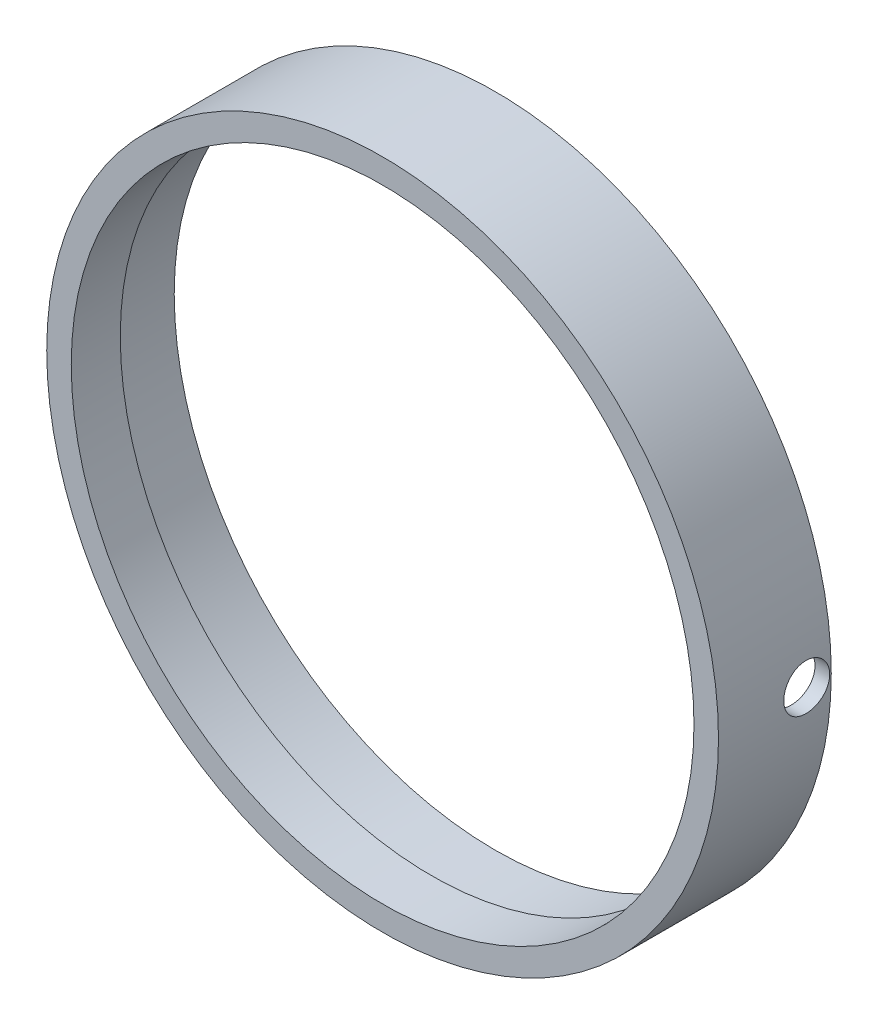
ISO-10303-21;
HEADER;
FILE_DESCRIPTION(('STEP AP214'),'2;1');
FILE_NAME('part.step','',(''),(''),'','','');
FILE_SCHEMA(('AUTOMOTIVE_DESIGN { 1 0 10303 214 1 1 1 1 }'));
ENDSEC;
DATA;
#1=APPLICATION_CONTEXT('core data for automotive mechanical design processes');
#2=APPLICATION_PROTOCOL_DEFINITION('international standard','automotive_design',2000,#1);
#3=PRODUCT_CONTEXT('',#1,'mechanical');
#4=PRODUCT('Part','Part','',(#3));
#5=PRODUCT_RELATED_PRODUCT_CATEGORY('part','',(#4));
#6=PRODUCT_DEFINITION_FORMATION('','',#4);
#7=PRODUCT_DEFINITION_CONTEXT('part definition',#1,'design');
#8=PRODUCT_DEFINITION('design','',#6,#7);
#9=PRODUCT_DEFINITION_SHAPE('','',#8);
#10=(LENGTH_UNIT() NAMED_UNIT(*) SI_UNIT(.MILLI.,.METRE.));
#11=(NAMED_UNIT(*) PLANE_ANGLE_UNIT() SI_UNIT($,.RADIAN.));
#12=(NAMED_UNIT(*) SI_UNIT($,.STERADIAN.) SOLID_ANGLE_UNIT());
#13=UNCERTAINTY_MEASURE_WITH_UNIT(LENGTH_MEASURE(1.E-05),#10,'distance_accuracy_value','');
#14=(GEOMETRIC_REPRESENTATION_CONTEXT(3) GLOBAL_UNCERTAINTY_ASSIGNED_CONTEXT((#13)) GLOBAL_UNIT_ASSIGNED_CONTEXT((#10,
#11,#12)) REPRESENTATION_CONTEXT('',''));
#15=CARTESIAN_POINT('',(0.,0.,0.));
#16=DIRECTION('',(0.,0.,1.));
#17=DIRECTION('',(1.,0.,0.));
#18=AXIS2_PLACEMENT_3D('',#15,#16,#17);
#19=CARTESIAN_POINT('',(0.,0.,11.684));
#20=DIRECTION('',(0.,0.,-1.));
#21=DIRECTION('',(-1.,0.,0.));
#22=AXIS2_PLACEMENT_3D('',#19,#20,#21);
#23=CYLINDRICAL_SURFACE('',#22,32.258);
#24=CARTESIAN_POINT('',(0.,0.,11.684));
#25=DIRECTION('',(0.,0.,1.));
#26=DIRECTION('',(1.,0.,0.));
#27=AXIS2_PLACEMENT_3D('',#24,#25,#26);
#28=CIRCLE('',#27,32.258);
#29=CARTESIAN_POINT('',(32.258,0.,11.684));
#30=VERTEX_POINT('',#29);
#31=EDGE_CURVE('E85',#30,#30,#28,.T.);
#32=ORIENTED_EDGE('',*,*,#31,.T.);
#33=EDGE_LOOP('',(#32));
#34=FACE_BOUND('',#33,.T.);
#35=CARTESIAN_POINT('',(0.,0.,6.604));
#36=DIRECTION('',(0.,0.,-1.));
#37=DIRECTION('',(-1.,0.,0.));
#38=AXIS2_PLACEMENT_3D('',#35,#36,#37);
#39=CIRCLE('',#38,32.258);
#40=CARTESIAN_POINT('',(-32.258,0.,6.604));
#41=VERTEX_POINT('',#40);
#42=EDGE_CURVE('E93',#41,#41,#39,.T.);
#43=ORIENTED_EDGE('',*,*,#42,.T.);
#44=EDGE_LOOP('',(#43));
#45=FACE_BOUND('',#44,.T.);
#46=ADVANCED_FACE('F35',(#34,#45),#23,.F.);
#47=CARTESIAN_POINT('',(0.,0.,11.684));
#48=DIRECTION('',(0.,0.,1.));
#49=DIRECTION('',(1.,0.,0.));
#50=AXIS2_PLACEMENT_3D('',#47,#48,#49);
#51=PLANE('',#50);
#52=CARTESIAN_POINT('',(0.,0.,11.684));
#53=DIRECTION('',(0.,0.,1.));
#54=DIRECTION('',(1.,0.,0.));
#55=AXIS2_PLACEMENT_3D('',#52,#53,#54);
#56=CIRCLE('',#55,34.798);
#57=CARTESIAN_POINT('',(34.798,0.,11.684));
#58=VERTEX_POINT('',#57);
#59=EDGE_CURVE('E48',#58,#58,#56,.T.);
#60=ORIENTED_EDGE('',*,*,#59,.T.);
#61=EDGE_LOOP('',(#60));
#62=FACE_BOUND('',#61,.T.);
#63=ORIENTED_EDGE('',*,*,#31,.F.);
#64=EDGE_LOOP('',(#63));
#65=FACE_BOUND('',#64,.T.);
#66=ADVANCED_FACE('F68',(#62,#65),#51,.T.);
#67=CARTESIAN_POINT('',(0.,0.,0.));
#68=DIRECTION('',(0.,0.,1.));
#69=DIRECTION('',(1.,0.,0.));
#70=AXIS2_PLACEMENT_3D('',#67,#68,#69);
#71=PLANE('',#70);
#72=CARTESIAN_POINT('',(0.,0.,0.));
#73=DIRECTION('',(0.,0.,-1.));
#74=DIRECTION('',(-1.,0.,0.));
#75=AXIS2_PLACEMENT_3D('',#72,#73,#74);
#76=CIRCLE('',#75,33.274);
#77=CARTESIAN_POINT('',(-33.274,0.,0.));
#78=VERTEX_POINT('',#77);
#79=EDGE_CURVE('E81',#78,#78,#76,.T.);
#80=ORIENTED_EDGE('',*,*,#79,.F.);
#81=EDGE_LOOP('',(#80));
#82=FACE_BOUND('',#81,.T.);
#83=CARTESIAN_POINT('',(0.,0.,0.));
#84=DIRECTION('',(0.,0.,1.));
#85=DIRECTION('',(1.,0.,0.));
#86=AXIS2_PLACEMENT_3D('',#83,#84,#85);
#87=CIRCLE('',#86,34.798);
#88=CARTESIAN_POINT('',(34.798,0.,0.));
#89=VERTEX_POINT('',#88);
#90=EDGE_CURVE('E52',#89,#89,#87,.T.);
#91=ORIENTED_EDGE('',*,*,#90,.F.);
#92=EDGE_LOOP('',(#91));
#93=FACE_BOUND('',#92,.T.);
#94=ADVANCED_FACE('F71',(#82,#93),#71,.F.);
#95=CARTESIAN_POINT('',(0.,0.,11.684));
#96=DIRECTION('',(0.,0.,-1.));
#97=DIRECTION('',(-1.,0.,0.));
#98=AXIS2_PLACEMENT_3D('',#95,#96,#97);
#99=CYLINDRICAL_SURFACE('',#98,34.798);
#100=CARTESIAN_POINT('',(34.798,0.,0.15875000000001));
#101=CARTESIAN_POINT('',(34.7979989208094,-0.133588155794999,0.158755867477085));
#102=CARTESIAN_POINT('',(34.7972225203374,-0.267269186276193,0.17002923049745));
#103=CARTESIAN_POINT('',(34.7941999484914,-0.530938106556214,0.214838030663603));
#104=CARTESIAN_POINT('',(34.7919520781104,-0.660921545744345,0.248399202687719));
#105=CARTESIAN_POINT('',(34.7862407908747,-0.913337990730339,0.336813463624141));
#106=CARTESIAN_POINT('',(34.7827780272686,-1.03577501272636,0.391655111693192));
#107=CARTESIAN_POINT('',(34.7750261272425,-1.26967444327123,0.521054515019886));
#108=CARTESIAN_POINT('',(34.7707371769327,-1.38113931492287,0.595607831353313));
#109=CARTESIAN_POINT('',(34.7618063164254,-1.59015862231136,0.762457878726961));
#110=CARTESIAN_POINT('',(34.7571638657219,-1.6876910728142,0.854782124877728));
#111=CARTESIAN_POINT('',(34.7480538278396,-1.86588872694902,1.05449605560255));
#112=CARTESIAN_POINT('',(34.7435862480674,-1.94655321677467,1.16188637741085));
#113=CARTESIAN_POINT('',(34.735325508655,-2.08879523711816,1.38881152089206));
#114=CARTESIAN_POINT('',(34.7315330087088,-2.15035414068139,1.50835804445394));
#115=CARTESIAN_POINT('',(34.725057240119,-2.25251844746636,1.75612020614468));
#116=CARTESIAN_POINT('',(34.7223739575974,-2.29312411284298,1.88433573578922));
#117=CARTESIAN_POINT('',(34.7184244498169,-2.35216732187229,2.14558151438049));
#118=CARTESIAN_POINT('',(34.7171559918817,-2.37063979642845,2.27860383442105));
#119=CARTESIAN_POINT('',(34.7161724973404,-2.38500011202866,2.54586669350074));
#120=CARTESIAN_POINT('',(34.7164574401908,-2.38088825174601,2.68010721640594));
#121=CARTESIAN_POINT('',(34.7185465421979,-2.35022556901186,2.94575752374605));
#122=CARTESIAN_POINT('',(34.7203481393947,-2.32371258666206,3.07717169882502));
#123=CARTESIAN_POINT('',(34.725263501563,-2.24905898416042,3.333680062673));
#124=CARTESIAN_POINT('',(34.7283772756694,-2.20091821344121,3.45877420743676));
#125=CARTESIAN_POINT('',(34.7355690563192,-2.0843327663931,3.69921287213977));
#126=CARTESIAN_POINT('',(34.7396478751699,-2.01587097281964,3.81454906687818));
#127=CARTESIAN_POINT('',(34.7483093165349,-1.86059924376167,4.03210684052555));
#128=CARTESIAN_POINT('',(34.7528919458749,-1.77378905967399,4.13432824171144));
#129=CARTESIAN_POINT('',(34.7620559853043,-1.58407187768573,4.32297486129699));
#130=CARTESIAN_POINT('',(34.7666373735015,-1.48113214066314,4.40936715927565));
#131=CARTESIAN_POINT('',(34.7752736268376,-1.26219256294727,4.56364912897192));
#132=CARTESIAN_POINT('',(34.7793284917564,-1.14619271678943,4.63153879294768));
#133=CARTESIAN_POINT('',(34.7864552196331,-0.904405395484275,4.74688575937018));
#134=CARTESIAN_POINT('',(34.7895270200034,-0.778617297791416,4.79434176095324));
#135=CARTESIAN_POINT('',(34.7943406807105,-0.520833283038195,4.86745204038675));
#136=CARTESIAN_POINT('',(34.7960825596609,-0.388837452888573,4.89310662336995));
#137=CARTESIAN_POINT('',(34.7980377077833,-0.122670405606603,4.9218449110496));
#138=CARTESIAN_POINT('',(34.7982540587103,0.011495876741912,4.92497412005104));
#139=CARTESIAN_POINT('',(34.7971419779868,0.278446350891906,4.90869180790779));
#140=CARTESIAN_POINT('',(34.7958135559984,0.411230551332504,4.8892804277453));
#141=CARTESIAN_POINT('',(34.7917634198029,0.671519019401444,4.82850564240906));
#142=CARTESIAN_POINT('',(34.7890430342566,0.799028196938187,4.78716316958168));
#143=CARTESIAN_POINT('',(34.7825149041612,1.04529878753559,4.68372104938293));
#144=CARTESIAN_POINT('',(34.7787071479126,1.1640601064575,4.62162117867379));
#145=CARTESIAN_POINT('',(34.7704241858098,1.38967183293355,4.47831159155507));
#146=CARTESIAN_POINT('',(34.7659479248373,1.49650293626651,4.39707154648404));
#147=CARTESIAN_POINT('',(34.7568350406239,1.6950272216822,4.2178317762269));
#148=CARTESIAN_POINT('',(34.7521984154985,1.78672022579394,4.11983185403093));
#149=CARTESIAN_POINT('',(34.7432783988478,1.95252012962449,3.90965757004761));
#150=CARTESIAN_POINT('',(34.738995608941,2.0265974636671,3.79745985579756));
#151=CARTESIAN_POINT('',(34.7312758896507,2.15486088629659,3.56219194163201));
#152=CARTESIAN_POINT('',(34.7278389542144,2.20904711722281,3.43912181952654));
#153=CARTESIAN_POINT('',(34.7222029051798,2.29593919867964,3.18570974320498));
#154=CARTESIAN_POINT('',(34.7200027270208,2.32866352698013,3.0553741494352));
#155=CARTESIAN_POINT('',(34.7170853801398,2.3717631800888,2.79104285291128));
#156=CARTESIAN_POINT('',(34.7163681932017,2.38213877941122,2.65704719513496));
#157=CARTESIAN_POINT('',(34.7164981541947,2.38024369030025,2.38949332983409));
#158=CARTESIAN_POINT('',(34.7173420919591,2.36801947427176,2.25593478910666));
#159=CARTESIAN_POINT('',(34.7204923990405,2.32136824968724,1.99277162594096));
#160=CARTESIAN_POINT('',(34.7227987709157,2.2869412022905,1.86316701041995));
#161=CARTESIAN_POINT('',(34.7286132483337,2.19687241258632,1.61158481031433));
#162=CARTESIAN_POINT('',(34.7321213325754,2.14123104631524,1.48960709058308));
#163=CARTESIAN_POINT('',(34.7399439024122,2.01031902753119,1.25671807466606));
#164=CARTESIAN_POINT('',(34.7442583692352,1.93504883195226,1.14580652095721));
#165=CARTESIAN_POINT('',(34.7532179498124,1.76684274301174,0.937961664407908));
#166=CARTESIAN_POINT('',(34.7578636874319,1.67387293630813,0.841055834749253));
#167=CARTESIAN_POINT('',(34.766956837543,1.4729583206572,0.664191126240124));
#168=CARTESIAN_POINT('',(34.7714042013766,1.36500986407391,0.584236387384639));
#169=CARTESIAN_POINT('',(34.7796049428549,1.13705788473562,0.443472496956665));
#170=CARTESIAN_POINT('',(34.7833573444482,1.01703776711531,0.382690189493511));
#171=CARTESIAN_POINT('',(34.7897327936469,0.768555912694078,0.282215074239805));
#172=CARTESIAN_POINT('',(34.7923571569944,0.640104213259933,0.242497683640819));
#173=CARTESIAN_POINT('',(34.7954966701789,0.425728038657167,0.195549824570133));
#174=CARTESIAN_POINT('',(34.7964312210327,0.341187585718439,0.18176786102411));
#175=CARTESIAN_POINT('',(34.7976832310778,0.171110791044775,0.163366077177971));
#176=CARTESIAN_POINT('',(34.7980006913124,0.0855744509938381,0.158746241387381));
#177=CARTESIAN_POINT('',(34.798,0.,0.15875000000001));
#178=B_SPLINE_CURVE_WITH_KNOTS('',3,(#100,#101,#102,#103,#104,#105,#106,#107,#108,#109,#110,
#111,#112,#113,#114,#115,#116,#117,#118,#119,#120,#121,#122,#123,#124,#125,#126,#127,#128,#129,
#130,#131,#132,#133,#134,#135,#136,#137,#138,#139,#140,#141,#142,#143,#144,#145,#146,#147,#148,
#149,#150,#151,#152,#153,#154,#155,#156,#157,#158,#159,#160,#161,#162,#163,#164,#165,#166,#167,
#168,#169,#170,#171,#172,#173,#174,#175,#176,#177),.UNSPECIFIED.,.T.,.F.,(4,2,2,2,2,2,2,2,2,2,2,
2,2,2,2,2,2,2,2,2,2,2,2,2,2,2,2,2,2,2,2,2,2,2,2,2,2,2,4),(0.,0.400452059116916,0.80136731069319,
1.20206731954265,1.60267717040827,2.00391235736963,2.4051645200805,2.80680666277132,
3.20844378022448,3.60944619004516,4.01044329670199,4.41076438790435,4.81108826608733,
5.21175031536587,5.61241779358075,6.01390932493959,6.41540102428953,6.81691827993793,
7.21842991585656,7.61913021569742,8.01982800933466,8.42014403934825,8.82046437667287,
9.22142336128118,9.62238705942603,10.0240190483162,10.4256481630999,10.8269310370663,
11.2282089819611,11.6286626894657,12.0291170975094,12.4295644075919,12.8300023966054,
13.2312155107453,13.6325265012805,14.0343969149798,14.4357973072277,14.692320970141,
14.9488441993476),.UNSPECIFIED.);
#179=CARTESIAN_POINT('',(34.798,0.,0.15875000000001));
#180=VERTEX_POINT('',#179);
#181=EDGE_CURVE('E10',#180,#180,#178,.T.);
#182=ORIENTED_EDGE('',*,*,#181,.T.);
#183=EDGE_LOOP('',(#182));
#184=FACE_BOUND('',#183,.T.);
#185=ORIENTED_EDGE('',*,*,#59,.F.);
#186=EDGE_LOOP('',(#185));
#187=FACE_BOUND('',#186,.T.);
#188=ORIENTED_EDGE('',*,*,#90,.T.);
#189=EDGE_LOOP('',(#188));
#190=FACE_BOUND('',#189,.T.);
#191=ADVANCED_FACE('F37',(#184,#187,#190),#99,.T.);
#192=CARTESIAN_POINT('',(34.798,0.,2.54));
#193=DIRECTION('',(1.,0.,0.));
#194=DIRECTION('',(0.,0.,-1.));
#195=AXIS2_PLACEMENT_3D('',#192,#193,#194);
#196=CYLINDRICAL_SURFACE('',#195,2.38124999999999);
#197=CARTESIAN_POINT('',(33.274,0.,0.15875000000001));
#198=CARTESIAN_POINT('',(33.2739988737244,-0.133572473206989,0.158755860728787));
#199=CARTESIAN_POINT('',(33.2731871054155,-0.267237435448319,0.170026588010757));
#200=CARTESIAN_POINT('',(33.2700268454573,-0.530873587533579,0.214824307626535));
#201=CARTESIAN_POINT('',(33.26767658428,-0.660840343981855,0.248376928567403));
#202=CARTESIAN_POINT('',(33.261705101585,-0.913223345449381,0.336767148824166));
#203=CARTESIAN_POINT('',(33.2580845701435,-1.03564364772198,0.39159319303229));
#204=CARTESIAN_POINT('',(33.2499792804922,-1.26951292642446,0.520954417545199));
#205=CARTESIAN_POINT('',(33.2454947150272,-1.38096434138216,0.595485203583386));
#206=CARTESIAN_POINT('',(33.2361554761372,-1.58997691639565,0.762295788793117));
#207=CARTESIAN_POINT('',(33.231300187637,-1.68751418708446,0.854605489292387));
#208=CARTESIAN_POINT('',(33.2217719345884,-1.86572511541398,1.05429112083756));
#209=CARTESIAN_POINT('',(33.2170989778184,-1.94639805424849,1.16166769375093));
#210=CARTESIAN_POINT('',(33.2084574690588,-2.08866759207331,1.38857905758738));
#211=CARTESIAN_POINT('',(33.2044896731167,-2.15024376827317,1.50812668451206));
#212=CARTESIAN_POINT('',(33.1977141169525,-2.25244130372666,1.75589688204931));
#213=CARTESIAN_POINT('',(33.1949063410622,-2.29306294601112,1.88411933546538));
#214=CARTESIAN_POINT('',(33.1907734541319,-2.35213049454748,2.14536450401277));
#215=CARTESIAN_POINT('',(33.1894457895118,-2.37061459796703,2.27837854170923));
#216=CARTESIAN_POINT('',(33.1884152089713,-2.38500032520364,2.54562741045199));
#217=CARTESIAN_POINT('',(33.1887122698192,-2.38090227191818,2.67986222401526));
#218=CARTESIAN_POINT('',(33.1908952713734,-2.35027165202637,2.94548134720518));
#219=CARTESIAN_POINT('',(33.1927782797317,-2.32378048897782,3.07687045885586));
#220=CARTESIAN_POINT('',(33.1979163793183,-2.24917989948963,3.33333235857956));
#221=CARTESIAN_POINT('',(33.2011714808486,-2.20107031073251,3.45840509921958));
#222=CARTESIAN_POINT('',(33.2086903416282,-2.08455177840496,3.69881650058299));
#223=CARTESIAN_POINT('',(33.2129550293012,-2.0161241353654,3.81414606815104));
#224=CARTESIAN_POINT('',(33.2220115978024,-1.86092542218461,4.03169792208378));
#225=CARTESIAN_POINT('',(33.2268034864596,-1.77415407961473,4.13392001374857));
#226=CARTESIAN_POINT('',(33.2363875161115,-1.5844982846787,4.3225960360652));
#227=CARTESIAN_POINT('',(33.2411796334131,-1.48157801574593,4.40901396946253));
#228=CARTESIAN_POINT('',(33.2502137960031,-1.26267121183346,4.56335066234292));
#229=CARTESIAN_POINT('',(33.2544558410376,-1.14668467082764,4.63126941329416));
#230=CARTESIAN_POINT('',(33.2619123820711,-0.904915291508661,4.74667705502997));
#231=CARTESIAN_POINT('',(33.2651268048439,-0.779131755877429,4.79416449000791));
#232=CARTESIAN_POINT('',(33.2701649856122,-0.521349063428546,4.86733699843846));
#233=CARTESIAN_POINT('',(33.2719887648929,-0.389350001778753,4.89302240559422));
#234=CARTESIAN_POINT('',(33.2740374221763,-0.123195424662408,4.92181692881077));
#235=CARTESIAN_POINT('',(33.2742658235823,0.010954682516354,4.92497579521906));
#236=CARTESIAN_POINT('',(33.273107376528,0.277877734827194,4.90875769380763));
#237=CARTESIAN_POINT('',(33.271720539131,0.410650689385505,4.88938088034131));
#238=CARTESIAN_POINT('',(33.2674899399966,0.670909670227605,4.82868266569094));
#239=CARTESIAN_POINT('',(33.2646477000172,0.798401068664429,4.78738418398835));
#240=CARTESIAN_POINT('',(33.257825863122,1.04464397846599,4.68403827396995));
#241=CARTESIAN_POINT('',(33.2538462528423,1.16339538711706,4.62199060185402));
#242=CARTESIAN_POINT('',(33.2451876277171,1.38901466175032,4.47878161833184));
#243=CARTESIAN_POINT('',(33.240507406139,1.495861458238,4.3975871869531));
#244=CARTESIAN_POINT('',(33.2309779748482,1.69442618660811,4.21843755746725));
#245=CARTESIAN_POINT('',(33.2261287629665,1.78614392423118,4.12048214417954));
#246=CARTESIAN_POINT('',(33.2167975842154,1.95201638830795,3.91037599976535));
#247=CARTESIAN_POINT('',(33.2123163035881,2.02613876287795,3.79819969314438));
#248=CARTESIAN_POINT('',(33.2042374001933,2.15449493707751,3.56296407055226));
#249=CARTESIAN_POINT('',(33.2006397706122,2.20872889006438,3.43990483850715));
#250=CARTESIAN_POINT('',(33.1947388842198,2.29571305735469,3.18651328366663));
#251=CARTESIAN_POINT('',(33.1924344143873,2.32848340997822,3.05618790333783));
#252=CARTESIAN_POINT('',(33.1893764006561,2.37167583691355,2.7918676310301));
#253=CARTESIAN_POINT('',(33.1886228356345,2.38209821559968,2.65787278905358));
#254=CARTESIAN_POINT('',(33.1887521363254,2.38029570295736,2.39033879427078));
#255=CARTESIAN_POINT('',(33.1896313279785,2.36812165855195,2.25679929414427));
#256=CARTESIAN_POINT('',(33.1929192815791,2.32157754233318,1.99366610427615));
#257=CARTESIAN_POINT('',(33.1953280461434,2.2872074325478,1.86407242128527));
#258=CARTESIAN_POINT('',(33.2014027895468,2.197258905111,1.61250376811644));
#259=CARTESIAN_POINT('',(33.2050687376104,2.14168100662009,1.49052861152424));
#260=CARTESIAN_POINT('',(33.2132447604897,2.01090085264889,1.25763302528));
#261=CARTESIAN_POINT('',(33.217754816903,1.93569902497908,1.14671235470804));
#262=CARTESIAN_POINT('',(33.2271228121385,1.76761581567832,0.938815150044854));
#263=CARTESIAN_POINT('',(33.2319814703468,1.6746971780809,0.841868770123552));
#264=CARTESIAN_POINT('',(33.2414927941254,1.47387761066793,0.664913765266534));
#265=CARTESIAN_POINT('',(33.246145409237,1.36597303735948,0.584909271348032));
#266=CARTESIAN_POINT('',(33.2547266269456,1.13808814988712,0.444031128748781));
#267=CARTESIAN_POINT('',(33.2586541452973,1.01809015989663,0.383186034999554));
#268=CARTESIAN_POINT('',(33.2653289788202,0.769638414179432,0.282583243261214));
#269=CARTESIAN_POINT('',(33.2680776652834,0.641194684860374,0.242801030881826));
#270=CARTESIAN_POINT('',(33.2713706732297,0.426646781836168,0.195710055781907));
#271=CARTESIAN_POINT('',(33.2723522462879,0.34192675263133,0.181868155683985));
#272=CARTESIAN_POINT('',(33.273667270633,0.171483856796275,0.163386254938782));
#273=CARTESIAN_POINT('',(33.2740007231319,0.0857609920415918,0.158746237084628));
#274=CARTESIAN_POINT('',(33.274,0.,0.15875000000001));
#275=B_SPLINE_CURVE_WITH_KNOTS('',3,(#197,#198,#199,#200,#201,#202,#203,#204,#205,#206,#207,
#208,#209,#210,#211,#212,#213,#214,#215,#216,#217,#218,#219,#220,#221,#222,#223,#224,#225,#226,
#227,#228,#229,#230,#231,#232,#233,#234,#235,#236,#237,#238,#239,#240,#241,#242,#243,#244,#245,
#246,#247,#248,#249,#250,#251,#252,#253,#254,#255,#256,#257,#258,#259,#260,#261,#262,#263,#264,
#265,#266,#267,#268,#269,#270,#271,#272,#273,#274),.UNSPECIFIED.,.T.,.F.,(4,2,2,2,2,2,2,2,2,2,2,
2,2,2,2,2,2,2,2,2,2,2,2,2,2,2,2,2,2,2,2,2,2,2,2,2,2,2,4),(0.,0.40040432421607,0.801269992512927,
1.20191822630039,1.6024771885651,2.00371580522178,2.40497152033413,2.80665488521285,
3.2083328244517,3.60931668624349,4.0102948144666,4.41053317500061,4.81077454069176,
5.2113854113598,5.61200223205665,6.01352047498536,6.41503890309396,6.81658593613537,
7.21812682296286,7.61878062272246,8.01943167830411,8.41966466899861,8.81990236254065,
9.22083753066266,9.6217778464515,10.0234497419113,10.4251185400608,10.826409928713,
11.2276958518327,11.628079887862,12.0284646088518,12.4288395291687,12.8292057218613,
13.2304233038208,13.6317386041285,14.0336492194432,14.4350910302718,14.6921734623769,
14.9492554137555),.UNSPECIFIED.);
#276=CARTESIAN_POINT('',(33.274,0.,0.15875000000001));
#277=VERTEX_POINT('',#276);
#278=EDGE_CURVE('E40',#277,#277,#275,.T.);
#279=ORIENTED_EDGE('',*,*,#278,.T.);
#280=EDGE_LOOP('',(#279));
#281=FACE_BOUND('',#280,.T.);
#282=ORIENTED_EDGE('',*,*,#181,.F.);
#283=EDGE_LOOP('',(#282));
#284=FACE_BOUND('',#283,.T.);
#285=ADVANCED_FACE('F57',(#281,#284),#196,.F.);
#286=CARTESIAN_POINT('',(0.,0.,6.604));
#287=DIRECTION('',(0.,0.,-1.));
#288=DIRECTION('',(-1.,0.,0.));
#289=AXIS2_PLACEMENT_3D('',#286,#287,#288);
#290=CYLINDRICAL_SURFACE('',#289,33.274);
#291=ORIENTED_EDGE('',*,*,#79,.T.);
#292=EDGE_LOOP('',(#291));
#293=FACE_BOUND('',#292,.T.);
#294=CARTESIAN_POINT('',(0.,0.,6.604));
#295=DIRECTION('',(0.,0.,-1.));
#296=DIRECTION('',(-1.,0.,0.));
#297=AXIS2_PLACEMENT_3D('',#294,#295,#296);
#298=CIRCLE('',#297,33.274);
#299=CARTESIAN_POINT('',(-33.274,0.,6.604));
#300=VERTEX_POINT('',#299);
#301=EDGE_CURVE('E90',#300,#300,#298,.T.);
#302=ORIENTED_EDGE('',*,*,#301,.F.);
#303=EDGE_LOOP('',(#302));
#304=FACE_BOUND('',#303,.T.);
#305=ORIENTED_EDGE('',*,*,#278,.F.);
#306=EDGE_LOOP('',(#305));
#307=FACE_BOUND('',#306,.T.);
#308=ADVANCED_FACE('F61',(#293,#304,#307),#290,.F.);
#309=CARTESIAN_POINT('',(0.,0.,6.604));
#310=DIRECTION('',(0.,0.,-1.));
#311=DIRECTION('',(-1.,0.,0.));
#312=AXIS2_PLACEMENT_3D('',#309,#310,#311);
#313=PLANE('',#312);
#314=ORIENTED_EDGE('',*,*,#42,.F.);
#315=EDGE_LOOP('',(#314));
#316=FACE_BOUND('',#315,.T.);
#317=ORIENTED_EDGE('',*,*,#301,.T.);
#318=EDGE_LOOP('',(#317));
#319=FACE_BOUND('',#318,.T.);
#320=ADVANCED_FACE('F100',(#316,#319),#313,.T.);
#321=CLOSED_SHELL('',(#46,#66,#94,#191,#285,#308,#320));
#322=MANIFOLD_SOLID_BREP('B2',#321);
#323=ADVANCED_BREP_SHAPE_REPRESENTATION('',(#18,#322),#14);
#324=SHAPE_DEFINITION_REPRESENTATION(#9,#323);
ENDSEC;
END-ISO-10303-21;
